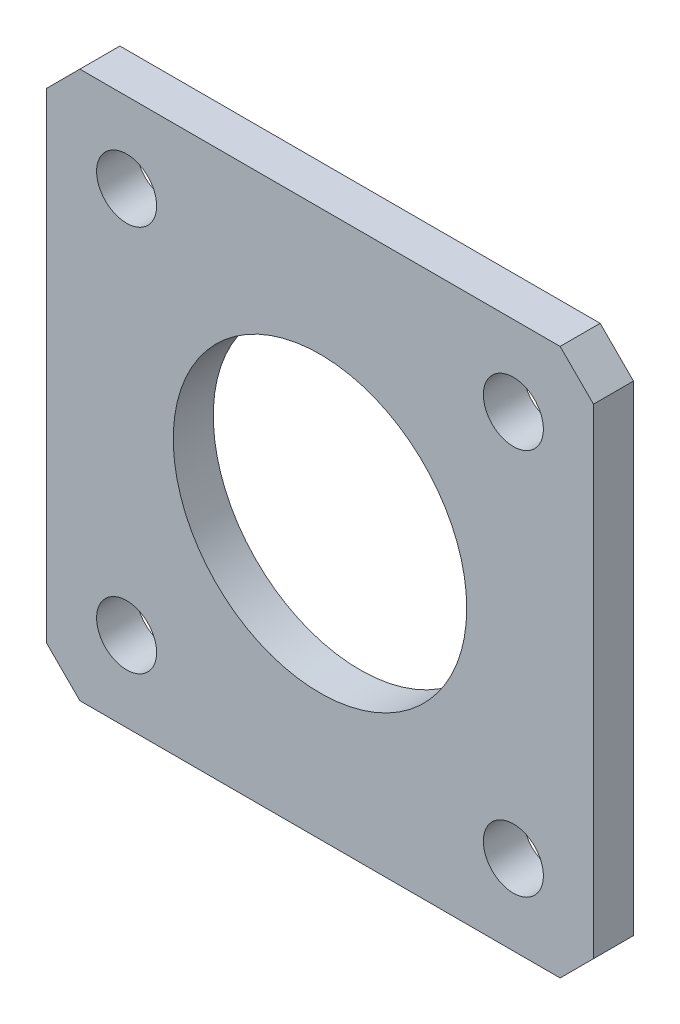
ISO-10303-21;
HEADER;
FILE_DESCRIPTION(('STEP AP214'),'2;1');
FILE_NAME('part.step','',(''),(''),'','','');
FILE_SCHEMA(('AUTOMOTIVE_DESIGN { 1 0 10303 214 1 1 1 1 }'));
ENDSEC;
DATA;
#1=APPLICATION_CONTEXT('core data for automotive mechanical design processes');
#2=APPLICATION_PROTOCOL_DEFINITION('international standard','automotive_design',2000,#1);
#3=PRODUCT_CONTEXT('',#1,'mechanical');
#4=PRODUCT('Part','Part','',(#3));
#5=PRODUCT_RELATED_PRODUCT_CATEGORY('part','',(#4));
#6=PRODUCT_DEFINITION_FORMATION('','',#4);
#7=PRODUCT_DEFINITION_CONTEXT('part definition',#1,'design');
#8=PRODUCT_DEFINITION('design','',#6,#7);
#9=PRODUCT_DEFINITION_SHAPE('','',#8);
#10=(LENGTH_UNIT() NAMED_UNIT(*) SI_UNIT(.MILLI.,.METRE.));
#11=(NAMED_UNIT(*) PLANE_ANGLE_UNIT() SI_UNIT($,.RADIAN.));
#12=(NAMED_UNIT(*) SI_UNIT($,.STERADIAN.) SOLID_ANGLE_UNIT());
#13=UNCERTAINTY_MEASURE_WITH_UNIT(LENGTH_MEASURE(1.E-05),#10,'distance_accuracy_value','');
#14=(GEOMETRIC_REPRESENTATION_CONTEXT(3) GLOBAL_UNCERTAINTY_ASSIGNED_CONTEXT((#13)) GLOBAL_UNIT_ASSIGNED_CONTEXT((#10,
#11,#12)) REPRESENTATION_CONTEXT('',''));
#15=CARTESIAN_POINT('',(0.,0.,0.));
#16=DIRECTION('',(0.,0.,1.));
#17=DIRECTION('',(1.,0.,0.));
#18=AXIS2_PLACEMENT_3D('',#15,#16,#17);
#19=CARTESIAN_POINT('',(20.5,20.5,3.));
#20=DIRECTION('',(0.,0.,-1.));
#21=DIRECTION('',(-1.,0.,0.));
#22=AXIS2_PLACEMENT_3D('',#19,#20,#21);
#23=PLANE('',#22);
#24=CARTESIAN_POINT('',(-14.4956890143242,-14.4956890143242,3.));
#25=DIRECTION('',(0.,0.,1.));
#26=DIRECTION('',(1.,0.,0.));
#27=AXIS2_PLACEMENT_3D('',#24,#25,#26);
#28=CIRCLE('',#27,2.25);
#29=CARTESIAN_POINT('',(-12.2456890143242,-14.4956890143242,3.));
#30=VERTEX_POINT('',#29);
#31=EDGE_CURVE('E223',#30,#30,#28,.T.);
#32=ORIENTED_EDGE('',*,*,#31,.F.);
#33=EDGE_LOOP('',(#32));
#34=FACE_BOUND('',#33,.T.);
#35=CARTESIAN_POINT('',(14.4956890143242,-14.4956890143242,3.));
#36=DIRECTION('',(0.,0.,1.));
#37=DIRECTION('',(1.,0.,0.));
#38=AXIS2_PLACEMENT_3D('',#35,#36,#37);
#39=CIRCLE('',#38,2.25);
#40=CARTESIAN_POINT('',(16.7456890143242,-14.4956890143242,3.));
#41=VERTEX_POINT('',#40);
#42=EDGE_CURVE('E216',#41,#41,#39,.T.);
#43=ORIENTED_EDGE('',*,*,#42,.F.);
#44=EDGE_LOOP('',(#43));
#45=FACE_BOUND('',#44,.T.);
#46=CARTESIAN_POINT('',(14.4956890143242,14.4956890143242,3.));
#47=DIRECTION('',(0.,0.,1.));
#48=DIRECTION('',(1.,0.,0.));
#49=AXIS2_PLACEMENT_3D('',#46,#47,#48);
#50=CIRCLE('',#49,2.25);
#51=CARTESIAN_POINT('',(16.7456890143242,14.4956890143242,3.));
#52=VERTEX_POINT('',#51);
#53=EDGE_CURVE('E208',#52,#52,#50,.T.);
#54=ORIENTED_EDGE('',*,*,#53,.F.);
#55=EDGE_LOOP('',(#54));
#56=FACE_BOUND('',#55,.T.);
#57=CARTESIAN_POINT('',(-14.4956890143242,14.4956890143242,3.));
#58=DIRECTION('',(0.,0.,1.));
#59=DIRECTION('',(1.,0.,0.));
#60=AXIS2_PLACEMENT_3D('',#57,#58,#59);
#61=CIRCLE('',#60,2.25);
#62=CARTESIAN_POINT('',(-12.2456890143242,14.4956890143242,3.));
#63=VERTEX_POINT('',#62);
#64=EDGE_CURVE('E200',#63,#63,#61,.T.);
#65=ORIENTED_EDGE('',*,*,#64,.F.);
#66=EDGE_LOOP('',(#65));
#67=FACE_BOUND('',#66,.T.);
#68=DIRECTION('',(-1.,0.,0.));
#69=VECTOR('',#68,1.);
#70=CARTESIAN_POINT('',(-20.5,20.5,3.));
#71=LINE('',#70,#69);
#72=CARTESIAN_POINT('',(18.,20.5,3.));
#73=VERTEX_POINT('',#72);
#74=CARTESIAN_POINT('',(-18.,20.5,3.));
#75=VERTEX_POINT('',#74);
#76=EDGE_CURVE('E178',#73,#75,#71,.T.);
#77=ORIENTED_EDGE('',*,*,#76,.T.);
#78=DIRECTION('',(0.707106781186549,0.707106781186546,0.));
#79=VECTOR('',#78,1.);
#80=CARTESIAN_POINT('',(-20.5,18.,3.));
#81=LINE('',#80,#79);
#82=CARTESIAN_POINT('',(-20.5,18.,3.));
#83=VERTEX_POINT('',#82);
#84=EDGE_CURVE('E156',#75,#83,#81,.F.);
#85=ORIENTED_EDGE('',*,*,#84,.T.);
#86=DIRECTION('',(0.,-1.,0.));
#87=VECTOR('',#86,1.);
#88=CARTESIAN_POINT('',(-20.5,-20.5,3.));
#89=LINE('',#88,#87);
#90=CARTESIAN_POINT('',(-20.5,-18.,3.));
#91=VERTEX_POINT('',#90);
#92=EDGE_CURVE('E122',#83,#91,#89,.T.);
#93=ORIENTED_EDGE('',*,*,#92,.T.);
#94=DIRECTION('',(-0.707106781186546,0.707106781186549,0.));
#95=VECTOR('',#94,1.);
#96=CARTESIAN_POINT('',(-18.,-20.5,3.));
#97=LINE('',#96,#95);
#98=CARTESIAN_POINT('',(-18.,-20.5,3.));
#99=VERTEX_POINT('',#98);
#100=EDGE_CURVE('E58',#91,#99,#97,.F.);
#101=ORIENTED_EDGE('',*,*,#100,.T.);
#102=DIRECTION('',(1.,0.,0.));
#103=VECTOR('',#102,1.);
#104=CARTESIAN_POINT('',(-20.5,-20.5,3.));
#105=LINE('',#104,#103);
#106=CARTESIAN_POINT('',(18.,-20.5,3.));
#107=VERTEX_POINT('',#106);
#108=EDGE_CURVE('E142',#99,#107,#105,.T.);
#109=ORIENTED_EDGE('',*,*,#108,.T.);
#110=DIRECTION('',(-0.707106781186549,-0.707106781186546,0.));
#111=VECTOR('',#110,1.);
#112=CARTESIAN_POINT('',(20.5,-18.,3.));
#113=LINE('',#112,#111);
#114=CARTESIAN_POINT('',(20.5,-18.,3.));
#115=VERTEX_POINT('',#114);
#116=EDGE_CURVE('E152',#107,#115,#113,.F.);
#117=ORIENTED_EDGE('',*,*,#116,.T.);
#118=DIRECTION('',(0.,1.,0.));
#119=VECTOR('',#118,1.);
#120=CARTESIAN_POINT('',(20.5,-20.5,3.));
#121=LINE('',#120,#119);
#122=CARTESIAN_POINT('',(20.5,18.,3.));
#123=VERTEX_POINT('',#122);
#124=EDGE_CURVE('E135',#115,#123,#121,.T.);
#125=ORIENTED_EDGE('',*,*,#124,.T.);
#126=DIRECTION('',(0.707106781186546,-0.707106781186549,0.));
#127=VECTOR('',#126,1.);
#128=CARTESIAN_POINT('',(18.,20.5,3.));
#129=LINE('',#128,#127);
#130=EDGE_CURVE('E154',#123,#73,#129,.F.);
#131=ORIENTED_EDGE('',*,*,#130,.T.);
#132=EDGE_LOOP('',(#77,#85,#93,#101,#109,#117,#125,#131));
#133=FACE_BOUND('',#132,.T.);
#134=CARTESIAN_POINT('',(0.,0.,3.));
#135=DIRECTION('',(0.,0.,1.));
#136=DIRECTION('',(1.,0.,0.));
#137=AXIS2_PLACEMENT_3D('',#134,#135,#136);
#138=CIRCLE('',#137,11.);
#139=CARTESIAN_POINT('',(11.,0.,3.));
#140=VERTEX_POINT('',#139);
#141=EDGE_CURVE('E188',#140,#140,#138,.T.);
#142=ORIENTED_EDGE('',*,*,#141,.F.);
#143=EDGE_LOOP('',(#142));
#144=FACE_BOUND('',#143,.T.);
#145=ADVANCED_FACE('F38',(#34,#45,#56,#67,#133,#144),#23,.F.);
#146=CARTESIAN_POINT('',(20.5,20.5,0.));
#147=DIRECTION('',(0.,0.,-1.));
#148=DIRECTION('',(-1.,0.,0.));
#149=AXIS2_PLACEMENT_3D('',#146,#147,#148);
#150=PLANE('',#149);
#151=CARTESIAN_POINT('',(-14.4956890143242,-14.4956890143242,0.));
#152=DIRECTION('',(0.,0.,1.));
#153=DIRECTION('',(1.,0.,0.));
#154=AXIS2_PLACEMENT_3D('',#151,#152,#153);
#155=CIRCLE('',#154,2.25);
#156=CARTESIAN_POINT('',(-12.2456890143242,-14.4956890143242,0.));
#157=VERTEX_POINT('',#156);
#158=EDGE_CURVE('E219',#157,#157,#155,.T.);
#159=ORIENTED_EDGE('',*,*,#158,.T.);
#160=EDGE_LOOP('',(#159));
#161=FACE_BOUND('',#160,.T.);
#162=CARTESIAN_POINT('',(14.4956890143242,-14.4956890143242,0.));
#163=DIRECTION('',(0.,0.,1.));
#164=DIRECTION('',(1.,0.,0.));
#165=AXIS2_PLACEMENT_3D('',#162,#163,#164);
#166=CIRCLE('',#165,2.25);
#167=CARTESIAN_POINT('',(16.7456890143242,-14.4956890143242,0.));
#168=VERTEX_POINT('',#167);
#169=EDGE_CURVE('E212',#168,#168,#166,.T.);
#170=ORIENTED_EDGE('',*,*,#169,.T.);
#171=EDGE_LOOP('',(#170));
#172=FACE_BOUND('',#171,.T.);
#173=CARTESIAN_POINT('',(14.4956890143242,14.4956890143242,0.));
#174=DIRECTION('',(0.,0.,1.));
#175=DIRECTION('',(1.,0.,0.));
#176=AXIS2_PLACEMENT_3D('',#173,#174,#175);
#177=CIRCLE('',#176,2.25);
#178=CARTESIAN_POINT('',(16.7456890143242,14.4956890143242,0.));
#179=VERTEX_POINT('',#178);
#180=EDGE_CURVE('E204',#179,#179,#177,.T.);
#181=ORIENTED_EDGE('',*,*,#180,.T.);
#182=EDGE_LOOP('',(#181));
#183=FACE_BOUND('',#182,.T.);
#184=CARTESIAN_POINT('',(-14.4956890143242,14.4956890143242,0.));
#185=DIRECTION('',(0.,0.,1.));
#186=DIRECTION('',(1.,0.,0.));
#187=AXIS2_PLACEMENT_3D('',#184,#185,#186);
#188=CIRCLE('',#187,2.25);
#189=CARTESIAN_POINT('',(-12.2456890143242,14.4956890143242,0.));
#190=VERTEX_POINT('',#189);
#191=EDGE_CURVE('E198',#190,#190,#188,.T.);
#192=ORIENTED_EDGE('',*,*,#191,.T.);
#193=EDGE_LOOP('',(#192));
#194=FACE_BOUND('',#193,.T.);
#195=DIRECTION('',(0.,-1.,0.));
#196=VECTOR('',#195,1.);
#197=CARTESIAN_POINT('',(-20.5,-20.5,0.));
#198=LINE('',#197,#196);
#199=CARTESIAN_POINT('',(-20.5,18.,0.));
#200=VERTEX_POINT('',#199);
#201=CARTESIAN_POINT('',(-20.5,-18.,0.));
#202=VERTEX_POINT('',#201);
#203=EDGE_CURVE('E120',#200,#202,#198,.T.);
#204=ORIENTED_EDGE('',*,*,#203,.F.);
#205=DIRECTION('',(-0.707106781186549,-0.707106781186546,0.));
#206=VECTOR('',#205,1.);
#207=CARTESIAN_POINT('',(1.25000000000008,39.75,0.));
#208=LINE('',#207,#206);
#209=CARTESIAN_POINT('',(-18.,20.5,0.));
#210=VERTEX_POINT('',#209);
#211=EDGE_CURVE('E103',#200,#210,#208,.F.);
#212=ORIENTED_EDGE('',*,*,#211,.T.);
#213=DIRECTION('',(-1.,0.,0.));
#214=VECTOR('',#213,1.);
#215=CARTESIAN_POINT('',(-20.5,20.5,0.));
#216=LINE('',#215,#214);
#217=CARTESIAN_POINT('',(18.,20.5,0.));
#218=VERTEX_POINT('',#217);
#219=EDGE_CURVE('E131',#218,#210,#216,.T.);
#220=ORIENTED_EDGE('',*,*,#219,.F.);
#221=DIRECTION('',(-0.707106781186546,0.707106781186549,0.));
#222=VECTOR('',#221,1.);
#223=CARTESIAN_POINT('',(19.25,19.25,0.));
#224=LINE('',#223,#222);
#225=CARTESIAN_POINT('',(20.5,18.,0.));
#226=VERTEX_POINT('',#225);
#227=EDGE_CURVE('E114',#218,#226,#224,.F.);
#228=ORIENTED_EDGE('',*,*,#227,.T.);
#229=DIRECTION('',(0.,1.,0.));
#230=VECTOR('',#229,1.);
#231=CARTESIAN_POINT('',(20.5,-20.5,0.));
#232=LINE('',#231,#230);
#233=CARTESIAN_POINT('',(20.5,-18.,0.));
#234=VERTEX_POINT('',#233);
#235=EDGE_CURVE('E138',#234,#226,#232,.T.);
#236=ORIENTED_EDGE('',*,*,#235,.F.);
#237=DIRECTION('',(0.707106781186549,0.707106781186546,0.));
#238=VECTOR('',#237,1.);
#239=CARTESIAN_POINT('',(39.75,1.24999999999986,0.));
#240=LINE('',#239,#238);
#241=CARTESIAN_POINT('',(18.,-20.5,0.));
#242=VERTEX_POINT('',#241);
#243=EDGE_CURVE('E145',#234,#242,#240,.F.);
#244=ORIENTED_EDGE('',*,*,#243,.T.);
#245=DIRECTION('',(1.,0.,0.));
#246=VECTOR('',#245,1.);
#247=CARTESIAN_POINT('',(-20.5,-20.5,0.));
#248=LINE('',#247,#246);
#249=CARTESIAN_POINT('',(-18.,-20.5,0.));
#250=VERTEX_POINT('',#249);
#251=EDGE_CURVE('E130',#250,#242,#248,.T.);
#252=ORIENTED_EDGE('',*,*,#251,.F.);
#253=DIRECTION('',(0.707106781186546,-0.707106781186549,0.));
#254=VECTOR('',#253,1.);
#255=CARTESIAN_POINT('',(-19.2500000000001,-19.2499999999999,0.));
#256=LINE('',#255,#254);
#257=EDGE_CURVE('E123',#250,#202,#256,.F.);
#258=ORIENTED_EDGE('',*,*,#257,.T.);
#259=EDGE_LOOP('',(#204,#212,#220,#228,#236,#244,#252,#258));
#260=FACE_BOUND('',#259,.T.);
#261=CARTESIAN_POINT('',(0.,0.,0.));
#262=DIRECTION('',(0.,0.,1.));
#263=DIRECTION('',(1.,0.,0.));
#264=AXIS2_PLACEMENT_3D('',#261,#262,#263);
#265=CIRCLE('',#264,11.);
#266=CARTESIAN_POINT('',(11.,0.,0.));
#267=VERTEX_POINT('',#266);
#268=EDGE_CURVE('E183',#267,#267,#265,.T.);
#269=ORIENTED_EDGE('',*,*,#268,.T.);
#270=EDGE_LOOP('',(#269));
#271=FACE_BOUND('',#270,.T.);
#272=ADVANCED_FACE('F126',(#161,#172,#183,#194,#260,#271),#150,.T.);
#273=CARTESIAN_POINT('',(20.5,-20.5,3.));
#274=DIRECTION('',(-1.,0.,0.));
#275=DIRECTION('',(0.,0.,1.));
#276=AXIS2_PLACEMENT_3D('',#273,#274,#275);
#277=PLANE('',#276);
#278=ORIENTED_EDGE('',*,*,#235,.T.);
#279=DIRECTION('',(0.,0.,1.));
#280=VECTOR('',#279,1.);
#281=CARTESIAN_POINT('',(20.5,18.,3.));
#282=LINE('',#281,#280);
#283=EDGE_CURVE('E161',#226,#123,#282,.T.);
#284=ORIENTED_EDGE('',*,*,#283,.T.);
#285=ORIENTED_EDGE('',*,*,#124,.F.);
#286=DIRECTION('',(0.,0.,-1.));
#287=VECTOR('',#286,1.);
#288=CARTESIAN_POINT('',(20.5,-18.,3.));
#289=LINE('',#288,#287);
#290=EDGE_CURVE('E158',#115,#234,#289,.T.);
#291=ORIENTED_EDGE('',*,*,#290,.T.);
#292=EDGE_LOOP('',(#278,#284,#285,#291));
#293=FACE_BOUND('',#292,.T.);
#294=ADVANCED_FACE('F174',(#293),#277,.F.);
#295=CARTESIAN_POINT('',(-20.5,20.5,3.));
#296=DIRECTION('',(0.,-1.,0.));
#297=DIRECTION('',(0.,0.,-1.));
#298=AXIS2_PLACEMENT_3D('',#295,#296,#297);
#299=PLANE('',#298);
#300=ORIENTED_EDGE('',*,*,#219,.T.);
#301=DIRECTION('',(0.,0.,1.));
#302=VECTOR('',#301,1.);
#303=CARTESIAN_POINT('',(-18.,20.5,3.));
#304=LINE('',#303,#302);
#305=EDGE_CURVE('E108',#210,#75,#304,.T.);
#306=ORIENTED_EDGE('',*,*,#305,.T.);
#307=ORIENTED_EDGE('',*,*,#76,.F.);
#308=DIRECTION('',(0.,0.,-1.));
#309=VECTOR('',#308,1.);
#310=CARTESIAN_POINT('',(18.,20.5,3.));
#311=LINE('',#310,#309);
#312=EDGE_CURVE('E113',#73,#218,#311,.T.);
#313=ORIENTED_EDGE('',*,*,#312,.T.);
#314=EDGE_LOOP('',(#300,#306,#307,#313));
#315=FACE_BOUND('',#314,.T.);
#316=ADVANCED_FACE('F255',(#315),#299,.F.);
#317=CARTESIAN_POINT('',(-20.5,-20.5,3.));
#318=DIRECTION('',(1.,0.,0.));
#319=DIRECTION('',(0.,0.,-1.));
#320=AXIS2_PLACEMENT_3D('',#317,#318,#319);
#321=PLANE('',#320);
#322=ORIENTED_EDGE('',*,*,#92,.F.);
#323=DIRECTION('',(0.,0.,-1.));
#324=VECTOR('',#323,1.);
#325=CARTESIAN_POINT('',(-20.5,18.,3.));
#326=LINE('',#325,#324);
#327=EDGE_CURVE('E107',#83,#200,#326,.T.);
#328=ORIENTED_EDGE('',*,*,#327,.T.);
#329=ORIENTED_EDGE('',*,*,#203,.T.);
#330=DIRECTION('',(0.,0.,1.));
#331=VECTOR('',#330,1.);
#332=CARTESIAN_POINT('',(-20.5,-18.,3.));
#333=LINE('',#332,#331);
#334=EDGE_CURVE('E124',#202,#91,#333,.T.);
#335=ORIENTED_EDGE('',*,*,#334,.T.);
#336=EDGE_LOOP('',(#322,#328,#329,#335));
#337=FACE_BOUND('',#336,.T.);
#338=ADVANCED_FACE('F119',(#337),#321,.F.);
#339=CARTESIAN_POINT('',(-20.5,-20.5,3.));
#340=DIRECTION('',(0.,1.,0.));
#341=DIRECTION('',(0.,0.,1.));
#342=AXIS2_PLACEMENT_3D('',#339,#340,#341);
#343=PLANE('',#342);
#344=ORIENTED_EDGE('',*,*,#251,.T.);
#345=DIRECTION('',(0.,0.,1.));
#346=VECTOR('',#345,1.);
#347=CARTESIAN_POINT('',(18.,-20.5,3.));
#348=LINE('',#347,#346);
#349=EDGE_CURVE('E11',#242,#107,#348,.T.);
#350=ORIENTED_EDGE('',*,*,#349,.T.);
#351=ORIENTED_EDGE('',*,*,#108,.F.);
#352=DIRECTION('',(0.,0.,-1.));
#353=VECTOR('',#352,1.);
#354=CARTESIAN_POINT('',(-18.,-20.5,3.));
#355=LINE('',#354,#353);
#356=EDGE_CURVE('E46',#99,#250,#355,.T.);
#357=ORIENTED_EDGE('',*,*,#356,.T.);
#358=EDGE_LOOP('',(#344,#350,#351,#357));
#359=FACE_BOUND('',#358,.T.);
#360=ADVANCED_FACE('F164',(#359),#343,.F.);
#361=CARTESIAN_POINT('',(0.,0.,3.));
#362=DIRECTION('',(0.,0.,-1.));
#363=DIRECTION('',(-1.,0.,0.));
#364=AXIS2_PLACEMENT_3D('',#361,#362,#363);
#365=CYLINDRICAL_SURFACE('',#364,11.);
#366=ORIENTED_EDGE('',*,*,#141,.T.);
#367=EDGE_LOOP('',(#366));
#368=FACE_BOUND('',#367,.T.);
#369=ORIENTED_EDGE('',*,*,#268,.F.);
#370=EDGE_LOOP('',(#369));
#371=FACE_BOUND('',#370,.T.);
#372=ADVANCED_FACE('F274',(#368,#371),#365,.F.);
#373=CARTESIAN_POINT('',(-14.4956890143242,14.4956890143242,0.));
#374=DIRECTION('',(0.,0.,1.));
#375=DIRECTION('',(1.,0.,0.));
#376=AXIS2_PLACEMENT_3D('',#373,#374,#375);
#377=CYLINDRICAL_SURFACE('',#376,2.25);
#378=ORIENTED_EDGE('',*,*,#191,.F.);
#379=EDGE_LOOP('',(#378));
#380=FACE_BOUND('',#379,.T.);
#381=ORIENTED_EDGE('',*,*,#64,.T.);
#382=EDGE_LOOP('',(#381));
#383=FACE_BOUND('',#382,.T.);
#384=ADVANCED_FACE('F279',(#380,#383),#377,.F.);
#385=CARTESIAN_POINT('',(14.4956890143242,14.4956890143242,0.));
#386=DIRECTION('',(0.,0.,1.));
#387=DIRECTION('',(1.,0.,0.));
#388=AXIS2_PLACEMENT_3D('',#385,#386,#387);
#389=CYLINDRICAL_SURFACE('',#388,2.25);
#390=ORIENTED_EDGE('',*,*,#180,.F.);
#391=EDGE_LOOP('',(#390));
#392=FACE_BOUND('',#391,.T.);
#393=ORIENTED_EDGE('',*,*,#53,.T.);
#394=EDGE_LOOP('',(#393));
#395=FACE_BOUND('',#394,.T.);
#396=ADVANCED_FACE('F282',(#392,#395),#389,.F.);
#397=CARTESIAN_POINT('',(14.4956890143242,-14.4956890143242,0.));
#398=DIRECTION('',(0.,0.,1.));
#399=DIRECTION('',(1.,0.,0.));
#400=AXIS2_PLACEMENT_3D('',#397,#398,#399);
#401=CYLINDRICAL_SURFACE('',#400,2.25);
#402=ORIENTED_EDGE('',*,*,#169,.F.);
#403=EDGE_LOOP('',(#402));
#404=FACE_BOUND('',#403,.T.);
#405=ORIENTED_EDGE('',*,*,#42,.T.);
#406=EDGE_LOOP('',(#405));
#407=FACE_BOUND('',#406,.T.);
#408=ADVANCED_FACE('F239',(#404,#407),#401,.F.);
#409=CARTESIAN_POINT('',(-14.4956890143242,-14.4956890143242,0.));
#410=DIRECTION('',(0.,0.,1.));
#411=DIRECTION('',(1.,0.,0.));
#412=AXIS2_PLACEMENT_3D('',#409,#410,#411);
#413=CYLINDRICAL_SURFACE('',#412,2.25);
#414=ORIENTED_EDGE('',*,*,#158,.F.);
#415=EDGE_LOOP('',(#414));
#416=FACE_BOUND('',#415,.T.);
#417=ORIENTED_EDGE('',*,*,#31,.T.);
#418=EDGE_LOOP('',(#417));
#419=FACE_BOUND('',#418,.T.);
#420=ADVANCED_FACE('F236',(#416,#419),#413,.F.);
#421=CARTESIAN_POINT('',(-20.5,18.,3.));
#422=DIRECTION('',(0.707106781186546,-0.707106781186549,0.));
#423=DIRECTION('',(0.707106781186549,0.707106781186546,0.));
#424=AXIS2_PLACEMENT_3D('',#421,#422,#423);
#425=PLANE('',#424);
#426=ORIENTED_EDGE('',*,*,#84,.F.);
#427=ORIENTED_EDGE('',*,*,#305,.F.);
#428=ORIENTED_EDGE('',*,*,#211,.F.);
#429=ORIENTED_EDGE('',*,*,#327,.F.);
#430=EDGE_LOOP('',(#426,#427,#428,#429));
#431=FACE_BOUND('',#430,.T.);
#432=ADVANCED_FACE('F106',(#431),#425,.F.);
#433=CARTESIAN_POINT('',(18.,20.5,3.));
#434=DIRECTION('',(-0.707106781186549,-0.707106781186546,0.));
#435=DIRECTION('',(0.707106781186546,-0.707106781186549,0.));
#436=AXIS2_PLACEMENT_3D('',#433,#434,#435);
#437=PLANE('',#436);
#438=ORIENTED_EDGE('',*,*,#130,.F.);
#439=ORIENTED_EDGE('',*,*,#283,.F.);
#440=ORIENTED_EDGE('',*,*,#227,.F.);
#441=ORIENTED_EDGE('',*,*,#312,.F.);
#442=EDGE_LOOP('',(#438,#439,#440,#441));
#443=FACE_BOUND('',#442,.T.);
#444=ADVANCED_FACE('F257',(#443),#437,.F.);
#445=CARTESIAN_POINT('',(20.5,-18.,3.));
#446=DIRECTION('',(-0.707106781186546,0.707106781186549,0.));
#447=DIRECTION('',(-0.707106781186549,-0.707106781186546,0.));
#448=AXIS2_PLACEMENT_3D('',#445,#446,#447);
#449=PLANE('',#448);
#450=ORIENTED_EDGE('',*,*,#116,.F.);
#451=ORIENTED_EDGE('',*,*,#349,.F.);
#452=ORIENTED_EDGE('',*,*,#243,.F.);
#453=ORIENTED_EDGE('',*,*,#290,.F.);
#454=EDGE_LOOP('',(#450,#451,#452,#453));
#455=FACE_BOUND('',#454,.T.);
#456=ADVANCED_FACE('F171',(#455),#449,.F.);
#457=CARTESIAN_POINT('',(-18.,-20.5,3.));
#458=DIRECTION('',(0.707106781186549,0.707106781186546,0.));
#459=DIRECTION('',(-0.707106781186546,0.707106781186549,0.));
#460=AXIS2_PLACEMENT_3D('',#457,#458,#459);
#461=PLANE('',#460);
#462=ORIENTED_EDGE('',*,*,#100,.F.);
#463=ORIENTED_EDGE('',*,*,#334,.F.);
#464=ORIENTED_EDGE('',*,*,#257,.F.);
#465=ORIENTED_EDGE('',*,*,#356,.F.);
#466=EDGE_LOOP('',(#462,#463,#464,#465));
#467=FACE_BOUND('',#466,.T.);
#468=ADVANCED_FACE('F40',(#467),#461,.F.);
#469=CLOSED_SHELL('',(#145,#272,#294,#316,#338,#360,#372,#384,#396,#408,#420,#432,#444,#456,#468));
#470=MANIFOLD_SOLID_BREP('B2',#469);
#471=ADVANCED_BREP_SHAPE_REPRESENTATION('',(#18,#470),#14);
#472=SHAPE_DEFINITION_REPRESENTATION(#9,#471);
ENDSEC;
END-ISO-10303-21;
